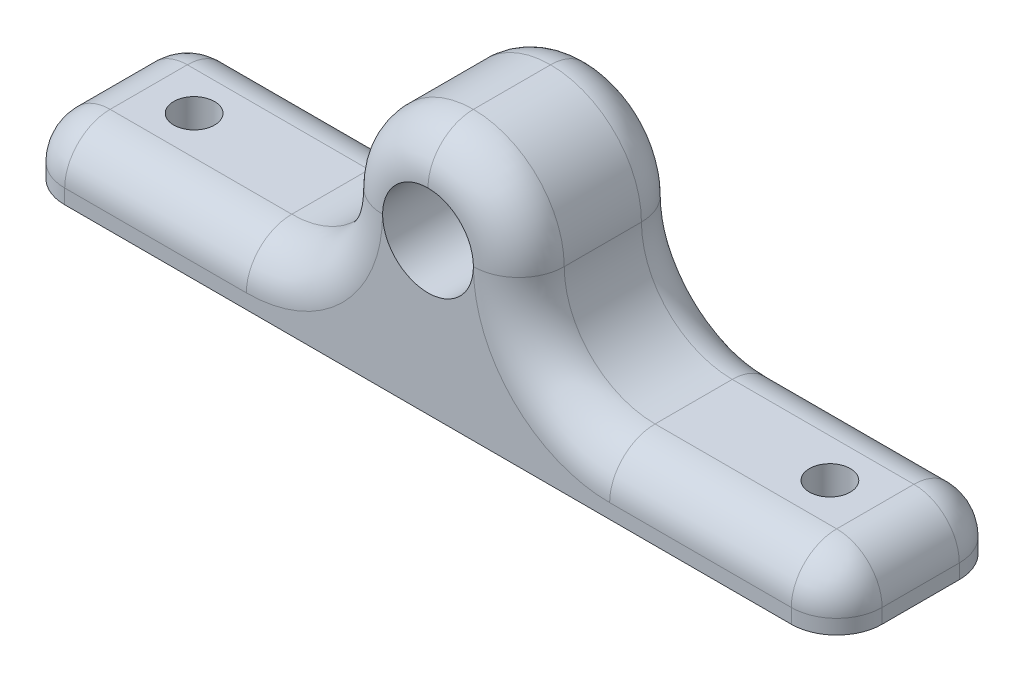
ISO-10303-21;
HEADER;
FILE_DESCRIPTION(('STEP AP214'),'2;1');
FILE_NAME('part.step','',(''),(''),'','','');
FILE_SCHEMA(('AUTOMOTIVE_DESIGN { 1 0 10303 214 1 1 1 1 }'));
ENDSEC;
DATA;
#1=APPLICATION_CONTEXT('core data for automotive mechanical design processes');
#2=APPLICATION_PROTOCOL_DEFINITION('international standard','automotive_design',2000,#1);
#3=PRODUCT_CONTEXT('',#1,'mechanical');
#4=PRODUCT('Part','Part','',(#3));
#5=PRODUCT_RELATED_PRODUCT_CATEGORY('part','',(#4));
#6=PRODUCT_DEFINITION_FORMATION('','',#4);
#7=PRODUCT_DEFINITION_CONTEXT('part definition',#1,'design');
#8=PRODUCT_DEFINITION('design','',#6,#7);
#9=PRODUCT_DEFINITION_SHAPE('','',#8);
#10=(LENGTH_UNIT() NAMED_UNIT(*) SI_UNIT(.MILLI.,.METRE.));
#11=(NAMED_UNIT(*) PLANE_ANGLE_UNIT() SI_UNIT($,.RADIAN.));
#12=(NAMED_UNIT(*) SI_UNIT($,.STERADIAN.) SOLID_ANGLE_UNIT());
#13=UNCERTAINTY_MEASURE_WITH_UNIT(LENGTH_MEASURE(1.E-05),#10,'distance_accuracy_value','');
#14=(GEOMETRIC_REPRESENTATION_CONTEXT(3) GLOBAL_UNCERTAINTY_ASSIGNED_CONTEXT((#13)) GLOBAL_UNIT_ASSIGNED_CONTEXT((#10,
#11,#12)) REPRESENTATION_CONTEXT('',''));
#15=CARTESIAN_POINT('',(0.,0.,0.));
#16=DIRECTION('',(0.,0.,1.));
#17=DIRECTION('',(1.,0.,0.));
#18=AXIS2_PLACEMENT_3D('',#15,#16,#17);
#19=CARTESIAN_POINT('',(0.,0.,18.5));
#20=DIRECTION('',(0.,0.,1.));
#21=DIRECTION('',(1.,0.,0.));
#22=AXIS2_PLACEMENT_3D('',#19,#20,#21);
#23=PLANE('',#22);
#24=CARTESIAN_POINT('',(-20.,0.,18.5));
#25=DIRECTION('',(0.,0.,1.));
#26=DIRECTION('',(1.,0.,0.));
#27=AXIS2_PLACEMENT_3D('',#24,#25,#26);
#28=CIRCLE('',#27,15.);
#29=CARTESIAN_POINT('',(-5.,0.,18.5));
#30=VERTEX_POINT('',#29);
#31=CARTESIAN_POINT('',(-20.,-15.,18.5));
#32=VERTEX_POINT('',#31);
#33=EDGE_CURVE('E255',#30,#32,#28,.F.);
#34=ORIENTED_EDGE('',*,*,#33,.T.);
#35=DIRECTION('',(-1.,0.,0.));
#36=VECTOR('',#35,1.);
#37=CARTESIAN_POINT('',(-40.,-15.,18.5));
#38=LINE('',#37,#36);
#39=CARTESIAN_POINT('',(-40.,-15.,18.5));
#40=VERTEX_POINT('',#39);
#41=EDGE_CURVE('E181',#32,#40,#38,.T.);
#42=ORIENTED_EDGE('',*,*,#41,.T.);
#43=DIRECTION('',(0.,-1.,0.));
#44=VECTOR('',#43,1.);
#45=CARTESIAN_POINT('',(-40.,-16.6,18.5));
#46=LINE('',#45,#44);
#47=CARTESIAN_POINT('',(-40.,-16.6,18.5));
#48=VERTEX_POINT('',#47);
#49=EDGE_CURVE('E174',#40,#48,#46,.T.);
#50=ORIENTED_EDGE('',*,*,#49,.T.);
#51=DIRECTION('',(1.,0.,0.));
#52=VECTOR('',#51,1.);
#53=CARTESIAN_POINT('',(-45.,-16.6,18.5));
#54=LINE('',#53,#52);
#55=CARTESIAN_POINT('',(40.,-16.6,18.5));
#56=VERTEX_POINT('',#55);
#57=EDGE_CURVE('E178',#48,#56,#54,.T.);
#58=ORIENTED_EDGE('',*,*,#57,.T.);
#59=DIRECTION('',(0.,1.,0.));
#60=VECTOR('',#59,1.);
#61=CARTESIAN_POINT('',(40.,-10.,18.5));
#62=LINE('',#61,#60);
#63=CARTESIAN_POINT('',(40.,-15.,18.5));
#64=VERTEX_POINT('',#63);
#65=EDGE_CURVE('E186',#56,#64,#62,.T.);
#66=ORIENTED_EDGE('',*,*,#65,.T.);
#67=DIRECTION('',(-1.,0.,0.));
#68=VECTOR('',#67,1.);
#69=CARTESIAN_POINT('',(20.,-15.,18.5));
#70=LINE('',#69,#68);
#71=CARTESIAN_POINT('',(20.,-15.,18.5));
#72=VERTEX_POINT('',#71);
#73=EDGE_CURVE('E251',#64,#72,#70,.T.);
#74=ORIENTED_EDGE('',*,*,#73,.T.);
#75=CARTESIAN_POINT('',(20.,0.,18.5));
#76=DIRECTION('',(0.,0.,1.));
#77=DIRECTION('',(1.,0.,0.));
#78=AXIS2_PLACEMENT_3D('',#75,#76,#77);
#79=CIRCLE('',#78,15.);
#80=CARTESIAN_POINT('',(5.,0.,18.5));
#81=VERTEX_POINT('',#80);
#82=EDGE_CURVE('E253',#72,#81,#79,.F.);
#83=ORIENTED_EDGE('',*,*,#82,.T.);
#84=CARTESIAN_POINT('',(0.,0.,18.5));
#85=DIRECTION('',(0.,0.,1.));
#86=DIRECTION('',(1.,0.,0.));
#87=AXIS2_PLACEMENT_3D('',#84,#85,#86);
#88=CIRCLE('',#87,5.);
#89=EDGE_CURVE('E370',#30,#81,#88,.T.);
#90=ORIENTED_EDGE('',*,*,#89,.F.);
#91=EDGE_LOOP('',(#34,#42,#50,#58,#66,#74,#83,#90));
#92=FACE_BOUND('',#91,.T.);
#93=ADVANCED_FACE('F36',(#92),#23,.T.);
#94=CARTESIAN_POINT('',(0.,0.,0.));
#95=DIRECTION('',(0.,0.,1.));
#96=DIRECTION('',(1.,0.,0.));
#97=AXIS2_PLACEMENT_3D('',#94,#95,#96);
#98=PLANE('',#97);
#99=CARTESIAN_POINT('',(20.,0.,0.));
#100=DIRECTION('',(0.,0.,1.));
#101=DIRECTION('',(1.,0.,0.));
#102=AXIS2_PLACEMENT_3D('',#99,#100,#101);
#103=CIRCLE('',#102,15.);
#104=CARTESIAN_POINT('',(5.,0.,0.));
#105=VERTEX_POINT('',#104);
#106=CARTESIAN_POINT('',(20.,-15.,0.));
#107=VERTEX_POINT('',#106);
#108=EDGE_CURVE('E59',#105,#107,#103,.T.);
#109=ORIENTED_EDGE('',*,*,#108,.T.);
#110=DIRECTION('',(-1.,0.,0.));
#111=VECTOR('',#110,1.);
#112=CARTESIAN_POINT('',(0.,-15.,0.));
#113=LINE('',#112,#111);
#114=CARTESIAN_POINT('',(40.,-15.,0.));
#115=VERTEX_POINT('',#114);
#116=EDGE_CURVE('E296',#107,#115,#113,.F.);
#117=ORIENTED_EDGE('',*,*,#116,.T.);
#118=DIRECTION('',(0.,1.,0.));
#119=VECTOR('',#118,1.);
#120=CARTESIAN_POINT('',(40.,0.,0.));
#121=LINE('',#120,#119);
#122=CARTESIAN_POINT('',(40.,-16.6,0.));
#123=VERTEX_POINT('',#122);
#124=EDGE_CURVE('E247',#115,#123,#121,.F.);
#125=ORIENTED_EDGE('',*,*,#124,.T.);
#126=DIRECTION('',(1.,0.,0.));
#127=VECTOR('',#126,1.);
#128=CARTESIAN_POINT('',(-45.,-16.6,0.));
#129=LINE('',#128,#127);
#130=CARTESIAN_POINT('',(-40.,-16.6,0.));
#131=VERTEX_POINT('',#130);
#132=EDGE_CURVE('E202',#131,#123,#129,.T.);
#133=ORIENTED_EDGE('',*,*,#132,.F.);
#134=DIRECTION('',(0.,-1.,0.));
#135=VECTOR('',#134,1.);
#136=CARTESIAN_POINT('',(-40.,0.,0.));
#137=LINE('',#136,#135);
#138=CARTESIAN_POINT('',(-40.,-15.,0.));
#139=VERTEX_POINT('',#138);
#140=EDGE_CURVE('E244',#131,#139,#137,.F.);
#141=ORIENTED_EDGE('',*,*,#140,.T.);
#142=DIRECTION('',(-1.,0.,0.));
#143=VECTOR('',#142,1.);
#144=CARTESIAN_POINT('',(0.,-15.,0.));
#145=LINE('',#144,#143);
#146=CARTESIAN_POINT('',(-20.,-15.,0.));
#147=VERTEX_POINT('',#146);
#148=EDGE_CURVE('E291',#139,#147,#145,.F.);
#149=ORIENTED_EDGE('',*,*,#148,.T.);
#150=CARTESIAN_POINT('',(-20.,0.,0.));
#151=DIRECTION('',(0.,0.,1.));
#152=DIRECTION('',(1.,0.,0.));
#153=AXIS2_PLACEMENT_3D('',#150,#151,#152);
#154=CIRCLE('',#153,15.);
#155=CARTESIAN_POINT('',(-5.,0.,0.));
#156=VERTEX_POINT('',#155);
#157=EDGE_CURVE('E293',#147,#156,#154,.T.);
#158=ORIENTED_EDGE('',*,*,#157,.T.);
#159=CARTESIAN_POINT('',(0.,0.,0.));
#160=DIRECTION('',(0.,0.,1.));
#161=DIRECTION('',(1.,0.,0.));
#162=AXIS2_PLACEMENT_3D('',#159,#160,#161);
#163=CIRCLE('',#162,5.);
#164=EDGE_CURVE('E231',#156,#105,#163,.T.);
#165=ORIENTED_EDGE('',*,*,#164,.T.);
#166=EDGE_LOOP('',(#109,#117,#125,#133,#141,#149,#158,#165));
#167=FACE_BOUND('',#166,.T.);
#168=ADVANCED_FACE('F384',(#167),#98,.F.);
#169=CARTESIAN_POINT('',(-45.,-10.,18.5));
#170=DIRECTION('',(0.,-1.,0.));
#171=DIRECTION('',(0.,0.,-1.));
#172=AXIS2_PLACEMENT_3D('',#169,#170,#171);
#173=PLANE('',#172);
#174=CARTESIAN_POINT('',(-35.,-10.,9.24999999999999));
#175=DIRECTION('',(0.,1.,0.));
#176=DIRECTION('',(0.,0.,1.));
#177=AXIS2_PLACEMENT_3D('',#174,#175,#176);
#178=CIRCLE('',#177,2.25);
#179=CARTESIAN_POINT('',(-35.,-10.,11.5));
#180=VERTEX_POINT('',#179);
#181=EDGE_CURVE('E354',#180,#180,#178,.T.);
#182=ORIENTED_EDGE('',*,*,#181,.F.);
#183=EDGE_LOOP('',(#182));
#184=FACE_BOUND('',#183,.T.);
#185=DIRECTION('',(0.,0.,-1.));
#186=VECTOR('',#185,1.);
#187=CARTESIAN_POINT('',(-40.,-10.,18.5));
#188=LINE('',#187,#186);
#189=CARTESIAN_POINT('',(-40.,-10.,5.));
#190=VERTEX_POINT('',#189);
#191=CARTESIAN_POINT('',(-40.,-10.,13.5));
#192=VERTEX_POINT('',#191);
#193=EDGE_CURVE('E258',#190,#192,#188,.F.);
#194=ORIENTED_EDGE('',*,*,#193,.T.);
#195=DIRECTION('',(-1.,0.,0.));
#196=VECTOR('',#195,1.);
#197=CARTESIAN_POINT('',(-20.,-10.,13.5));
#198=LINE('',#197,#196);
#199=CARTESIAN_POINT('',(-20.,-10.,13.5));
#200=VERTEX_POINT('',#199);
#201=EDGE_CURVE('E262',#192,#200,#198,.F.);
#202=ORIENTED_EDGE('',*,*,#201,.T.);
#203=DIRECTION('',(0.,0.,-1.));
#204=VECTOR('',#203,1.);
#205=CARTESIAN_POINT('',(-20.,-10.,0.));
#206=LINE('',#205,#204);
#207=CARTESIAN_POINT('',(-20.,-10.,5.));
#208=VERTEX_POINT('',#207);
#209=EDGE_CURVE('E218',#200,#208,#206,.T.);
#210=ORIENTED_EDGE('',*,*,#209,.T.);
#211=DIRECTION('',(-1.,0.,0.));
#212=VECTOR('',#211,1.);
#213=CARTESIAN_POINT('',(-45.,-10.,5.));
#214=LINE('',#213,#212);
#215=EDGE_CURVE('E260',#208,#190,#214,.T.);
#216=ORIENTED_EDGE('',*,*,#215,.T.);
#217=EDGE_LOOP('',(#194,#202,#210,#216));
#218=FACE_BOUND('',#217,.T.);
#219=ADVANCED_FACE('F434',(#184,#218),#173,.F.);
#220=CARTESIAN_POINT('',(-45.,-10.,18.5));
#221=DIRECTION('',(1.,0.,0.));
#222=DIRECTION('',(0.,1.,0.));
#223=AXIS2_PLACEMENT_3D('',#220,#221,#222);
#224=PLANE('',#223);
#225=DIRECTION('',(0.,-1.,0.));
#226=VECTOR('',#225,1.);
#227=CARTESIAN_POINT('',(-45.,-10.,13.5));
#228=LINE('',#227,#226);
#229=CARTESIAN_POINT('',(-45.,-16.6,13.5));
#230=VERTEX_POINT('',#229);
#231=CARTESIAN_POINT('',(-45.,-15.,13.5));
#232=VERTEX_POINT('',#231);
#233=EDGE_CURVE('E191',#230,#232,#228,.F.);
#234=ORIENTED_EDGE('',*,*,#233,.T.);
#235=DIRECTION('',(0.,0.,-1.));
#236=VECTOR('',#235,1.);
#237=CARTESIAN_POINT('',(-45.,-15.,18.5));
#238=LINE('',#237,#236);
#239=CARTESIAN_POINT('',(-45.,-15.,5.));
#240=VERTEX_POINT('',#239);
#241=EDGE_CURVE('E11',#232,#240,#238,.T.);
#242=ORIENTED_EDGE('',*,*,#241,.T.);
#243=DIRECTION('',(0.,-1.,0.));
#244=VECTOR('',#243,1.);
#245=CARTESIAN_POINT('',(-45.,-10.,5.));
#246=LINE('',#245,#244);
#247=CARTESIAN_POINT('',(-45.,-16.6,5.));
#248=VERTEX_POINT('',#247);
#249=EDGE_CURVE('E195',#240,#248,#246,.T.);
#250=ORIENTED_EDGE('',*,*,#249,.T.);
#251=DIRECTION('',(0.,0.,-1.));
#252=VECTOR('',#251,1.);
#253=CARTESIAN_POINT('',(-45.,-16.6,18.5));
#254=LINE('',#253,#252);
#255=EDGE_CURVE('E205',#230,#248,#254,.T.);
#256=ORIENTED_EDGE('',*,*,#255,.F.);
#257=EDGE_LOOP('',(#234,#242,#250,#256));
#258=FACE_BOUND('',#257,.T.);
#259=ADVANCED_FACE('F442',(#258),#224,.F.);
#260=CARTESIAN_POINT('',(-45.,-16.6,18.5));
#261=DIRECTION('',(0.,1.,0.));
#262=DIRECTION('',(0.,0.,1.));
#263=AXIS2_PLACEMENT_3D('',#260,#261,#262);
#264=PLANE('',#263);
#265=CARTESIAN_POINT('',(-35.,-16.6,9.24999999999999));
#266=DIRECTION('',(0.,1.,0.));
#267=DIRECTION('',(0.,0.,1.));
#268=AXIS2_PLACEMENT_3D('',#265,#266,#267);
#269=CIRCLE('',#268,2.25);
#270=CARTESIAN_POINT('',(-35.,-16.6,11.5));
#271=VERTEX_POINT('',#270);
#272=EDGE_CURVE('E358',#271,#271,#269,.T.);
#273=ORIENTED_EDGE('',*,*,#272,.T.);
#274=EDGE_LOOP('',(#273));
#275=FACE_BOUND('',#274,.T.);
#276=CARTESIAN_POINT('',(35.,-16.6,9.24999999999999));
#277=DIRECTION('',(0.,1.,0.));
#278=DIRECTION('',(0.,0.,1.));
#279=AXIS2_PLACEMENT_3D('',#276,#277,#278);
#280=CIRCLE('',#279,2.25);
#281=CARTESIAN_POINT('',(35.,-16.6,11.5));
#282=VERTEX_POINT('',#281);
#283=EDGE_CURVE('E225',#282,#282,#280,.T.);
#284=ORIENTED_EDGE('',*,*,#283,.T.);
#285=EDGE_LOOP('',(#284));
#286=FACE_BOUND('',#285,.T.);
#287=ORIENTED_EDGE('',*,*,#57,.F.);
#288=CARTESIAN_POINT('',(-40.,-16.6,13.5));
#289=DIRECTION('',(0.,1.,0.));
#290=DIRECTION('',(0.,0.,1.));
#291=AXIS2_PLACEMENT_3D('',#288,#289,#290);
#292=CIRCLE('',#291,5.);
#293=EDGE_CURVE('E189',#48,#230,#292,.F.);
#294=ORIENTED_EDGE('',*,*,#293,.T.);
#295=ORIENTED_EDGE('',*,*,#255,.T.);
#296=CARTESIAN_POINT('',(-40.,-16.6,5.));
#297=DIRECTION('',(0.,1.,0.));
#298=DIRECTION('',(0.,0.,1.));
#299=AXIS2_PLACEMENT_3D('',#296,#297,#298);
#300=CIRCLE('',#299,5.);
#301=EDGE_CURVE('E185',#248,#131,#300,.F.);
#302=ORIENTED_EDGE('',*,*,#301,.T.);
#303=ORIENTED_EDGE('',*,*,#132,.T.);
#304=CARTESIAN_POINT('',(40.,-16.6,5.));
#305=DIRECTION('',(0.,1.,0.));
#306=DIRECTION('',(0.,0.,1.));
#307=AXIS2_PLACEMENT_3D('',#304,#305,#306);
#308=CIRCLE('',#307,5.);
#309=CARTESIAN_POINT('',(45.,-16.6,5.));
#310=VERTEX_POINT('',#309);
#311=EDGE_CURVE('E234',#123,#310,#308,.F.);
#312=ORIENTED_EDGE('',*,*,#311,.T.);
#313=DIRECTION('',(0.,0.,-1.));
#314=VECTOR('',#313,1.);
#315=CARTESIAN_POINT('',(45.,-16.6,18.5));
#316=LINE('',#315,#314);
#317=CARTESIAN_POINT('',(45.,-16.6,13.5));
#318=VERTEX_POINT('',#317);
#319=EDGE_CURVE('E201',#318,#310,#316,.T.);
#320=ORIENTED_EDGE('',*,*,#319,.F.);
#321=CARTESIAN_POINT('',(40.,-16.6,13.5));
#322=DIRECTION('',(0.,1.,0.));
#323=DIRECTION('',(0.,0.,1.));
#324=AXIS2_PLACEMENT_3D('',#321,#322,#323);
#325=CIRCLE('',#324,5.);
#326=EDGE_CURVE('E196',#318,#56,#325,.F.);
#327=ORIENTED_EDGE('',*,*,#326,.T.);
#328=EDGE_LOOP('',(#287,#294,#295,#302,#303,#312,#320,#327));
#329=FACE_BOUND('',#328,.T.);
#330=ADVANCED_FACE('F198',(#275,#286,#329),#264,.F.);
#331=CARTESIAN_POINT('',(45.,-10.,18.5));
#332=DIRECTION('',(-1.,0.,0.));
#333=DIRECTION('',(0.,0.,1.));
#334=AXIS2_PLACEMENT_3D('',#331,#332,#333);
#335=PLANE('',#334);
#336=DIRECTION('',(0.,1.,0.));
#337=VECTOR('',#336,1.);
#338=CARTESIAN_POINT('',(45.,-10.,5.));
#339=LINE('',#338,#337);
#340=CARTESIAN_POINT('',(45.,-15.,5.));
#341=VERTEX_POINT('',#340);
#342=EDGE_CURVE('E239',#310,#341,#339,.T.);
#343=ORIENTED_EDGE('',*,*,#342,.T.);
#344=DIRECTION('',(0.,0.,-1.));
#345=VECTOR('',#344,1.);
#346=CARTESIAN_POINT('',(45.,-15.,18.5));
#347=LINE('',#346,#345);
#348=CARTESIAN_POINT('',(45.,-15.,13.5));
#349=VERTEX_POINT('',#348);
#350=EDGE_CURVE('E45',#341,#349,#347,.F.);
#351=ORIENTED_EDGE('',*,*,#350,.T.);
#352=DIRECTION('',(0.,1.,0.));
#353=VECTOR('',#352,1.);
#354=CARTESIAN_POINT('',(45.,-16.6,13.5));
#355=LINE('',#354,#353);
#356=EDGE_CURVE('E242',#349,#318,#355,.F.);
#357=ORIENTED_EDGE('',*,*,#356,.T.);
#358=ORIENTED_EDGE('',*,*,#319,.T.);
#359=EDGE_LOOP('',(#343,#351,#357,#358));
#360=FACE_BOUND('',#359,.T.);
#361=ADVANCED_FACE('F425',(#360),#335,.F.);
#362=CARTESIAN_POINT('',(10.,-10.,18.5));
#363=DIRECTION('',(0.,-1.,0.));
#364=DIRECTION('',(0.,0.,-1.));
#365=AXIS2_PLACEMENT_3D('',#362,#363,#364);
#366=PLANE('',#365);
#367=DIRECTION('',(0.,0.,-1.));
#368=VECTOR('',#367,1.);
#369=CARTESIAN_POINT('',(20.,-10.,18.5));
#370=LINE('',#369,#368);
#371=CARTESIAN_POINT('',(20.,-10.,5.));
#372=VERTEX_POINT('',#371);
#373=CARTESIAN_POINT('',(20.,-10.,13.5));
#374=VERTEX_POINT('',#373);
#375=EDGE_CURVE('E215',#372,#374,#370,.F.);
#376=ORIENTED_EDGE('',*,*,#375,.T.);
#377=DIRECTION('',(-1.,0.,0.));
#378=VECTOR('',#377,1.);
#379=CARTESIAN_POINT('',(40.,-10.,13.5));
#380=LINE('',#379,#378);
#381=CARTESIAN_POINT('',(40.,-10.,13.5));
#382=VERTEX_POINT('',#381);
#383=EDGE_CURVE('E285',#374,#382,#380,.F.);
#384=ORIENTED_EDGE('',*,*,#383,.T.);
#385=DIRECTION('',(0.,0.,-1.));
#386=VECTOR('',#385,1.);
#387=CARTESIAN_POINT('',(40.,-10.,18.5));
#388=LINE('',#387,#386);
#389=CARTESIAN_POINT('',(40.,-10.,5.));
#390=VERTEX_POINT('',#389);
#391=EDGE_CURVE('E281',#382,#390,#388,.T.);
#392=ORIENTED_EDGE('',*,*,#391,.T.);
#393=DIRECTION('',(-1.,0.,0.));
#394=VECTOR('',#393,1.);
#395=CARTESIAN_POINT('',(10.,-10.,5.));
#396=LINE('',#395,#394);
#397=EDGE_CURVE('E283',#390,#372,#396,.T.);
#398=ORIENTED_EDGE('',*,*,#397,.T.);
#399=EDGE_LOOP('',(#376,#384,#392,#398));
#400=FACE_BOUND('',#399,.T.);
#401=CARTESIAN_POINT('',(35.,-10.,9.24999999999999));
#402=DIRECTION('',(0.,1.,0.));
#403=DIRECTION('',(0.,0.,1.));
#404=AXIS2_PLACEMENT_3D('',#401,#402,#403);
#405=CIRCLE('',#404,2.25);
#406=CARTESIAN_POINT('',(35.,-10.,11.5));
#407=VERTEX_POINT('',#406);
#408=EDGE_CURVE('E363',#407,#407,#405,.T.);
#409=ORIENTED_EDGE('',*,*,#408,.F.);
#410=EDGE_LOOP('',(#409));
#411=FACE_BOUND('',#410,.T.);
#412=ADVANCED_FACE('F417',(#400,#411),#366,.F.);
#413=CARTESIAN_POINT('',(0.,0.,18.5));
#414=DIRECTION('',(0.,0.,-1.));
#415=DIRECTION('',(-1.,0.,0.));
#416=AXIS2_PLACEMENT_3D('',#413,#414,#415);
#417=CYLINDRICAL_SURFACE('',#416,5.);
#418=CARTESIAN_POINT('',(0.,5.,18.5));
#419=VERTEX_POINT('',#418);
#420=EDGE_CURVE('E208',#81,#419,#88,.T.);
#421=ORIENTED_EDGE('',*,*,#420,.T.);
#422=EDGE_CURVE('E369',#419,#30,#88,.T.);
#423=ORIENTED_EDGE('',*,*,#422,.T.);
#424=ORIENTED_EDGE('',*,*,#89,.T.);
#425=EDGE_LOOP('',(#421,#423,#424));
#426=FACE_BOUND('',#425,.T.);
#427=CARTESIAN_POINT('',(0.,5.,0.));
#428=VERTEX_POINT('',#427);
#429=EDGE_CURVE('E211',#105,#428,#163,.T.);
#430=ORIENTED_EDGE('',*,*,#429,.F.);
#431=ORIENTED_EDGE('',*,*,#164,.F.);
#432=EDGE_CURVE('E378',#428,#156,#163,.T.);
#433=ORIENTED_EDGE('',*,*,#432,.F.);
#434=EDGE_LOOP('',(#430,#431,#433));
#435=FACE_BOUND('',#434,.T.);
#436=ADVANCED_FACE('F387',(#426,#435),#417,.F.);
#437=CARTESIAN_POINT('',(-20.,0.,18.5));
#438=DIRECTION('',(0.,0.,1.));
#439=DIRECTION('',(1.,0.,0.));
#440=AXIS2_PLACEMENT_3D('',#437,#438,#439);
#441=CYLINDRICAL_SURFACE('',#440,10.);
#442=ORIENTED_EDGE('',*,*,#209,.F.);
#443=CARTESIAN_POINT('',(-20.,0.,13.5));
#444=DIRECTION('',(0.,0.,1.));
#445=DIRECTION('',(1.,0.,0.));
#446=AXIS2_PLACEMENT_3D('',#443,#444,#445);
#447=CIRCLE('',#446,10.);
#448=CARTESIAN_POINT('',(-10.,0.,13.5));
#449=VERTEX_POINT('',#448);
#450=EDGE_CURVE('E267',#200,#449,#447,.T.);
#451=ORIENTED_EDGE('',*,*,#450,.T.);
#452=DIRECTION('',(0.,0.,-1.));
#453=VECTOR('',#452,1.);
#454=CARTESIAN_POINT('',(-10.,0.,18.5));
#455=LINE('',#454,#453);
#456=CARTESIAN_POINT('',(-10.,0.,5.));
#457=VERTEX_POINT('',#456);
#458=EDGE_CURVE('E228',#457,#449,#455,.F.);
#459=ORIENTED_EDGE('',*,*,#458,.F.);
#460=CARTESIAN_POINT('',(-20.,0.,5.));
#461=DIRECTION('',(0.,0.,1.));
#462=DIRECTION('',(1.,0.,0.));
#463=AXIS2_PLACEMENT_3D('',#460,#461,#462);
#464=CIRCLE('',#463,10.);
#465=EDGE_CURVE('E265',#457,#208,#464,.F.);
#466=ORIENTED_EDGE('',*,*,#465,.T.);
#467=EDGE_LOOP('',(#442,#451,#459,#466));
#468=FACE_BOUND('',#467,.T.);
#469=ADVANCED_FACE('F416',(#468),#441,.F.);
#470=CARTESIAN_POINT('',(0.,0.,18.5));
#471=DIRECTION('',(0.,0.,-1.));
#472=DIRECTION('',(-1.,0.,0.));
#473=AXIS2_PLACEMENT_3D('',#470,#471,#472);
#474=CYLINDRICAL_SURFACE('',#473,10.);
#475=ORIENTED_EDGE('',*,*,#458,.T.);
#476=CARTESIAN_POINT('',(0.,0.,13.5));
#477=DIRECTION('',(0.,0.,1.));
#478=DIRECTION('',(1.,0.,0.));
#479=AXIS2_PLACEMENT_3D('',#476,#477,#478);
#480=CIRCLE('',#479,10.);
#481=CARTESIAN_POINT('',(0.,10.,13.5));
#482=VERTEX_POINT('',#481);
#483=EDGE_CURVE('E271',#449,#482,#480,.F.);
#484=ORIENTED_EDGE('',*,*,#483,.T.);
#485=DIRECTION('',(0.,0.,-1.));
#486=VECTOR('',#485,1.);
#487=CARTESIAN_POINT('',(0.,10.,18.5));
#488=LINE('',#487,#486);
#489=CARTESIAN_POINT('',(0.,10.,5.));
#490=VERTEX_POINT('',#489);
#491=EDGE_CURVE('E224',#490,#482,#488,.F.);
#492=ORIENTED_EDGE('',*,*,#491,.F.);
#493=CARTESIAN_POINT('',(0.,0.,5.));
#494=DIRECTION('',(0.,0.,1.));
#495=DIRECTION('',(1.,0.,0.));
#496=AXIS2_PLACEMENT_3D('',#493,#494,#495);
#497=CIRCLE('',#496,10.);
#498=EDGE_CURVE('E269',#490,#457,#497,.T.);
#499=ORIENTED_EDGE('',*,*,#498,.T.);
#500=EDGE_LOOP('',(#475,#484,#492,#499));
#501=FACE_BOUND('',#500,.T.);
#502=ADVANCED_FACE('F402',(#501),#474,.T.);
#503=CARTESIAN_POINT('',(0.,0.,18.5));
#504=DIRECTION('',(0.,0.,-1.));
#505=DIRECTION('',(-1.,0.,0.));
#506=AXIS2_PLACEMENT_3D('',#503,#504,#505);
#507=CYLINDRICAL_SURFACE('',#506,10.);
#508=ORIENTED_EDGE('',*,*,#491,.T.);
#509=CARTESIAN_POINT('',(0.,0.,13.5));
#510=DIRECTION('',(0.,0.,1.));
#511=DIRECTION('',(1.,0.,0.));
#512=AXIS2_PLACEMENT_3D('',#509,#510,#511);
#513=CIRCLE('',#512,10.);
#514=CARTESIAN_POINT('',(10.,0.,13.5));
#515=VERTEX_POINT('',#514);
#516=EDGE_CURVE('E275',#482,#515,#513,.F.);
#517=ORIENTED_EDGE('',*,*,#516,.T.);
#518=DIRECTION('',(0.,0.,-1.));
#519=VECTOR('',#518,1.);
#520=CARTESIAN_POINT('',(10.,0.,18.5));
#521=LINE('',#520,#519);
#522=CARTESIAN_POINT('',(10.,0.,5.));
#523=VERTEX_POINT('',#522);
#524=EDGE_CURVE('E221',#523,#515,#521,.F.);
#525=ORIENTED_EDGE('',*,*,#524,.F.);
#526=CARTESIAN_POINT('',(0.,0.,5.));
#527=DIRECTION('',(0.,0.,1.));
#528=DIRECTION('',(1.,0.,0.));
#529=AXIS2_PLACEMENT_3D('',#526,#527,#528);
#530=CIRCLE('',#529,10.);
#531=EDGE_CURVE('E273',#523,#490,#530,.T.);
#532=ORIENTED_EDGE('',*,*,#531,.T.);
#533=EDGE_LOOP('',(#508,#517,#525,#532));
#534=FACE_BOUND('',#533,.T.);
#535=ADVANCED_FACE('F399',(#534),#507,.T.);
#536=CARTESIAN_POINT('',(20.,0.,18.5));
#537=DIRECTION('',(0.,0.,1.));
#538=DIRECTION('',(1.,0.,0.));
#539=AXIS2_PLACEMENT_3D('',#536,#537,#538);
#540=CYLINDRICAL_SURFACE('',#539,10.);
#541=ORIENTED_EDGE('',*,*,#524,.T.);
#542=CARTESIAN_POINT('',(20.,0.,13.5));
#543=DIRECTION('',(0.,0.,1.));
#544=DIRECTION('',(1.,0.,0.));
#545=AXIS2_PLACEMENT_3D('',#542,#543,#544);
#546=CIRCLE('',#545,10.);
#547=EDGE_CURVE('E279',#515,#374,#546,.T.);
#548=ORIENTED_EDGE('',*,*,#547,.T.);
#549=ORIENTED_EDGE('',*,*,#375,.F.);
#550=CARTESIAN_POINT('',(20.,0.,5.));
#551=DIRECTION('',(0.,0.,1.));
#552=DIRECTION('',(1.,0.,0.));
#553=AXIS2_PLACEMENT_3D('',#550,#551,#552);
#554=CIRCLE('',#553,10.);
#555=EDGE_CURVE('E277',#372,#523,#554,.F.);
#556=ORIENTED_EDGE('',*,*,#555,.T.);
#557=EDGE_LOOP('',(#541,#548,#549,#556));
#558=FACE_BOUND('',#557,.T.);
#559=ADVANCED_FACE('F449',(#558),#540,.F.);
#560=CARTESIAN_POINT('',(35.,-10.,9.24999999999999));
#561=DIRECTION('',(0.,1.,0.));
#562=DIRECTION('',(0.,0.,1.));
#563=AXIS2_PLACEMENT_3D('',#560,#561,#562);
#564=CYLINDRICAL_SURFACE('',#563,2.25);
#565=ORIENTED_EDGE('',*,*,#283,.F.);
#566=EDGE_LOOP('',(#565));
#567=FACE_BOUND('',#566,.T.);
#568=ORIENTED_EDGE('',*,*,#408,.T.);
#569=EDGE_LOOP('',(#568));
#570=FACE_BOUND('',#569,.T.);
#571=ADVANCED_FACE('F452',(#567,#570),#564,.F.);
#572=CARTESIAN_POINT('',(-35.,-10.,9.24999999999999));
#573=DIRECTION('',(0.,1.,0.));
#574=DIRECTION('',(0.,0.,1.));
#575=AXIS2_PLACEMENT_3D('',#572,#573,#574);
#576=CYLINDRICAL_SURFACE('',#575,2.25);
#577=ORIENTED_EDGE('',*,*,#272,.F.);
#578=EDGE_LOOP('',(#577));
#579=FACE_BOUND('',#578,.T.);
#580=ORIENTED_EDGE('',*,*,#181,.T.);
#581=EDGE_LOOP('',(#580));
#582=FACE_BOUND('',#581,.T.);
#583=ADVANCED_FACE('F461',(#579,#582),#576,.F.);
#584=CARTESIAN_POINT('',(-40.,0.,13.5));
#585=DIRECTION('',(0.,1.,0.));
#586=DIRECTION('',(-1.,0.,0.));
#587=AXIS2_PLACEMENT_3D('',#584,#585,#586);
#588=CYLINDRICAL_SURFACE('',#587,5.);
#589=ORIENTED_EDGE('',*,*,#49,.F.);
#590=CARTESIAN_POINT('',(-40.,-15.,13.5));
#591=DIRECTION('',(0.,1.,0.));
#592=DIRECTION('',(-1.,0.,0.));
#593=AXIS2_PLACEMENT_3D('',#590,#591,#592);
#594=CIRCLE('',#593,5.);
#595=EDGE_CURVE('E249',#40,#232,#594,.F.);
#596=ORIENTED_EDGE('',*,*,#595,.T.);
#597=ORIENTED_EDGE('',*,*,#233,.F.);
#598=ORIENTED_EDGE('',*,*,#293,.F.);
#599=EDGE_LOOP('',(#589,#596,#597,#598));
#600=FACE_BOUND('',#599,.T.);
#601=ADVANCED_FACE('F190',(#600),#588,.T.);
#602=CARTESIAN_POINT('',(40.,0.,13.5));
#603=DIRECTION('',(0.,-1.,0.));
#604=DIRECTION('',(0.,0.,-1.));
#605=AXIS2_PLACEMENT_3D('',#602,#603,#604);
#606=CYLINDRICAL_SURFACE('',#605,5.);
#607=ORIENTED_EDGE('',*,*,#356,.F.);
#608=CARTESIAN_POINT('',(40.,-15.,13.5));
#609=DIRECTION('',(0.,-1.,0.));
#610=DIRECTION('',(0.,0.,-1.));
#611=AXIS2_PLACEMENT_3D('',#608,#609,#610);
#612=CIRCLE('',#611,5.);
#613=EDGE_CURVE('E287',#349,#64,#612,.T.);
#614=ORIENTED_EDGE('',*,*,#613,.T.);
#615=ORIENTED_EDGE('',*,*,#65,.F.);
#616=ORIENTED_EDGE('',*,*,#326,.F.);
#617=EDGE_LOOP('',(#607,#614,#615,#616));
#618=FACE_BOUND('',#617,.T.);
#619=ADVANCED_FACE('F460',(#618),#606,.T.);
#620=CARTESIAN_POINT('',(40.,-10.,5.));
#621=DIRECTION('',(0.,1.,0.));
#622=DIRECTION('',(0.,0.,1.));
#623=AXIS2_PLACEMENT_3D('',#620,#621,#622);
#624=CYLINDRICAL_SURFACE('',#623,5.);
#625=ORIENTED_EDGE('',*,*,#124,.F.);
#626=CARTESIAN_POINT('',(40.,-15.,5.));
#627=DIRECTION('',(0.,1.,0.));
#628=DIRECTION('',(0.,0.,1.));
#629=AXIS2_PLACEMENT_3D('',#626,#627,#628);
#630=CIRCLE('',#629,5.);
#631=EDGE_CURVE('E289',#115,#341,#630,.F.);
#632=ORIENTED_EDGE('',*,*,#631,.T.);
#633=ORIENTED_EDGE('',*,*,#342,.F.);
#634=ORIENTED_EDGE('',*,*,#311,.F.);
#635=EDGE_LOOP('',(#625,#632,#633,#634));
#636=FACE_BOUND('',#635,.T.);
#637=ADVANCED_FACE('F464',(#636),#624,.T.);
#638=CARTESIAN_POINT('',(-40.,-10.,5.));
#639=DIRECTION('',(0.,-1.,0.));
#640=DIRECTION('',(1.,0.,0.));
#641=AXIS2_PLACEMENT_3D('',#638,#639,#640);
#642=CYLINDRICAL_SURFACE('',#641,5.);
#643=ORIENTED_EDGE('',*,*,#249,.F.);
#644=CARTESIAN_POINT('',(-40.,-15.,5.));
#645=DIRECTION('',(0.,-1.,0.));
#646=DIRECTION('',(1.,0.,0.));
#647=AXIS2_PLACEMENT_3D('',#644,#645,#646);
#648=CIRCLE('',#647,5.);
#649=EDGE_CURVE('E298',#240,#139,#648,.T.);
#650=ORIENTED_EDGE('',*,*,#649,.T.);
#651=ORIENTED_EDGE('',*,*,#140,.F.);
#652=ORIENTED_EDGE('',*,*,#301,.F.);
#653=EDGE_LOOP('',(#643,#650,#651,#652));
#654=FACE_BOUND('',#653,.T.);
#655=ADVANCED_FACE('F468',(#654),#642,.T.);
#656=CARTESIAN_POINT('',(40.,-15.,5.));
#657=DIRECTION('',(0.,-1.,0.));
#658=DIRECTION('',(0.,0.,-1.));
#659=AXIS2_PLACEMENT_3D('',#656,#657,#658);
#660=SPHERICAL_SURFACE('',#659,5.);
#661=CARTESIAN_POINT('',(40.,-15.,5.));
#662=DIRECTION('',(0.,0.,1.));
#663=DIRECTION('',(1.,0.,0.));
#664=AXIS2_PLACEMENT_3D('',#661,#662,#663);
#665=CIRCLE('',#664,5.);
#666=EDGE_CURVE('E346',#341,#390,#665,.T.);
#667=ORIENTED_EDGE('',*,*,#666,.F.);
#668=ORIENTED_EDGE('',*,*,#631,.F.);
#669=CARTESIAN_POINT('',(40.,-15.,5.));
#670=DIRECTION('',(-1.,0.,0.));
#671=DIRECTION('',(0.,0.,1.));
#672=AXIS2_PLACEMENT_3D('',#669,#670,#671);
#673=CIRCLE('',#672,5.);
#674=EDGE_CURVE('E40',#390,#115,#673,.T.);
#675=ORIENTED_EDGE('',*,*,#674,.F.);
#676=EDGE_LOOP('',(#667,#668,#675));
#677=FACE_BOUND('',#676,.T.);
#678=ADVANCED_FACE('F38',(#677),#660,.T.);
#679=CARTESIAN_POINT('',(10.,-15.,5.));
#680=DIRECTION('',(-1.,0.,0.));
#681=DIRECTION('',(0.,0.,1.));
#682=AXIS2_PLACEMENT_3D('',#679,#680,#681);
#683=CYLINDRICAL_SURFACE('',#682,5.);
#684=ORIENTED_EDGE('',*,*,#674,.T.);
#685=ORIENTED_EDGE('',*,*,#116,.F.);
#686=CARTESIAN_POINT('',(20.,-15.,5.));
#687=DIRECTION('',(-1.,0.,0.));
#688=DIRECTION('',(0.,0.,1.));
#689=AXIS2_PLACEMENT_3D('',#686,#687,#688);
#690=CIRCLE('',#689,5.);
#691=EDGE_CURVE('E344',#372,#107,#690,.T.);
#692=ORIENTED_EDGE('',*,*,#691,.F.);
#693=ORIENTED_EDGE('',*,*,#397,.F.);
#694=EDGE_LOOP('',(#684,#685,#692,#693));
#695=FACE_BOUND('',#694,.T.);
#696=ADVANCED_FACE('F527',(#695),#683,.T.);
#697=CARTESIAN_POINT('',(40.,-15.,18.5));
#698=DIRECTION('',(0.,0.,-1.));
#699=DIRECTION('',(-1.,0.,0.));
#700=AXIS2_PLACEMENT_3D('',#697,#698,#699);
#701=CYLINDRICAL_SURFACE('',#700,5.);
#702=ORIENTED_EDGE('',*,*,#666,.T.);
#703=ORIENTED_EDGE('',*,*,#391,.F.);
#704=CARTESIAN_POINT('',(40.,-15.,13.5));
#705=DIRECTION('',(0.,0.,1.));
#706=DIRECTION('',(1.,0.,0.));
#707=AXIS2_PLACEMENT_3D('',#704,#705,#706);
#708=CIRCLE('',#707,5.);
#709=EDGE_CURVE('E341',#349,#382,#708,.T.);
#710=ORIENTED_EDGE('',*,*,#709,.F.);
#711=ORIENTED_EDGE('',*,*,#350,.F.);
#712=EDGE_LOOP('',(#702,#703,#710,#711));
#713=FACE_BOUND('',#712,.T.);
#714=ADVANCED_FACE('F525',(#713),#701,.T.);
#715=CARTESIAN_POINT('',(20.,0.,5.));
#716=DIRECTION('',(0.,0.,1.));
#717=DIRECTION('',(1.,0.,0.));
#718=AXIS2_PLACEMENT_3D('',#715,#716,#717);
#719=TOROIDAL_SURFACE('',#718,15.,5.);
#720=ORIENTED_EDGE('',*,*,#691,.T.);
#721=ORIENTED_EDGE('',*,*,#108,.F.);
#722=CARTESIAN_POINT('',(5.,0.,5.));
#723=DIRECTION('',(0.,1.,0.));
#724=DIRECTION('',(-1.,0.,0.));
#725=AXIS2_PLACEMENT_3D('',#722,#723,#724);
#726=CIRCLE('',#725,5.);
#727=EDGE_CURVE('E338',#523,#105,#726,.T.);
#728=ORIENTED_EDGE('',*,*,#727,.F.);
#729=ORIENTED_EDGE('',*,*,#555,.F.);
#730=EDGE_LOOP('',(#720,#721,#728,#729));
#731=FACE_BOUND('',#730,.T.);
#732=ADVANCED_FACE('F390',(#731),#719,.T.);
#733=CARTESIAN_POINT('',(40.,-15.,13.5));
#734=DIRECTION('',(0.,-1.,0.));
#735=DIRECTION('',(0.,0.,-1.));
#736=AXIS2_PLACEMENT_3D('',#733,#734,#735);
#737=SPHERICAL_SURFACE('',#736,5.);
#738=ORIENTED_EDGE('',*,*,#613,.F.);
#739=ORIENTED_EDGE('',*,*,#709,.T.);
#740=CARTESIAN_POINT('',(40.,-15.,13.5));
#741=DIRECTION('',(-1.,0.,0.));
#742=DIRECTION('',(0.,0.,1.));
#743=AXIS2_PLACEMENT_3D('',#740,#741,#742);
#744=CIRCLE('',#743,5.);
#745=EDGE_CURVE('E335',#64,#382,#744,.T.);
#746=ORIENTED_EDGE('',*,*,#745,.F.);
#747=EDGE_LOOP('',(#738,#739,#746));
#748=FACE_BOUND('',#747,.T.);
#749=ADVANCED_FACE('F519',(#748),#737,.T.);
#750=CARTESIAN_POINT('',(0.,0.,5.));
#751=DIRECTION('',(0.,0.,1.));
#752=DIRECTION('',(1.,0.,0.));
#753=AXIS2_PLACEMENT_3D('',#750,#751,#752);
#754=DEGENERATE_TOROIDAL_SURFACE('',#753,5.,5.,.T.);
#755=ORIENTED_EDGE('',*,*,#727,.T.);
#756=ORIENTED_EDGE('',*,*,#429,.T.);
#757=CARTESIAN_POINT('',(0.,5.,5.));
#758=DIRECTION('',(-1.,0.,0.));
#759=DIRECTION('',(0.,-1.,0.));
#760=AXIS2_PLACEMENT_3D('',#757,#758,#759);
#761=CIRCLE('',#760,5.);
#762=EDGE_CURVE('E332',#490,#428,#761,.T.);
#763=ORIENTED_EDGE('',*,*,#762,.F.);
#764=ORIENTED_EDGE('',*,*,#531,.F.);
#765=EDGE_LOOP('',(#755,#756,#763,#764));
#766=FACE_BOUND('',#765,.T.);
#767=ADVANCED_FACE('F394',(#766),#754,.T.);
#768=CARTESIAN_POINT('',(0.,-15.,13.5));
#769=DIRECTION('',(1.,0.,0.));
#770=DIRECTION('',(0.,0.,-1.));
#771=AXIS2_PLACEMENT_3D('',#768,#769,#770);
#772=CYLINDRICAL_SURFACE('',#771,5.);
#773=ORIENTED_EDGE('',*,*,#745,.T.);
#774=ORIENTED_EDGE('',*,*,#383,.F.);
#775=CARTESIAN_POINT('',(20.,-15.,13.5));
#776=DIRECTION('',(-1.,0.,0.));
#777=DIRECTION('',(0.,0.,1.));
#778=AXIS2_PLACEMENT_3D('',#775,#776,#777);
#779=CIRCLE('',#778,5.);
#780=EDGE_CURVE('E329',#72,#374,#779,.T.);
#781=ORIENTED_EDGE('',*,*,#780,.F.);
#782=ORIENTED_EDGE('',*,*,#73,.F.);
#783=EDGE_LOOP('',(#773,#774,#781,#782));
#784=FACE_BOUND('',#783,.T.);
#785=ADVANCED_FACE('F512',(#784),#772,.T.);
#786=CARTESIAN_POINT('',(0.,0.,5.));
#787=DIRECTION('',(0.,0.,1.));
#788=DIRECTION('',(1.,0.,0.));
#789=AXIS2_PLACEMENT_3D('',#786,#787,#788);
#790=DEGENERATE_TOROIDAL_SURFACE('',#789,5.,5.,.T.);
#791=ORIENTED_EDGE('',*,*,#762,.T.);
#792=ORIENTED_EDGE('',*,*,#432,.T.);
#793=CARTESIAN_POINT('',(-5.,0.,5.));
#794=DIRECTION('',(0.,-1.,0.));
#795=DIRECTION('',(1.,0.,0.));
#796=AXIS2_PLACEMENT_3D('',#793,#794,#795);
#797=CIRCLE('',#796,5.);
#798=EDGE_CURVE('E326',#457,#156,#797,.T.);
#799=ORIENTED_EDGE('',*,*,#798,.F.);
#800=ORIENTED_EDGE('',*,*,#498,.F.);
#801=EDGE_LOOP('',(#791,#792,#799,#800));
#802=FACE_BOUND('',#801,.T.);
#803=ADVANCED_FACE('F508',(#802),#790,.T.);
#804=CARTESIAN_POINT('',(20.,0.,13.5));
#805=DIRECTION('',(0.,0.,1.));
#806=DIRECTION('',(1.,0.,0.));
#807=AXIS2_PLACEMENT_3D('',#804,#805,#806);
#808=TOROIDAL_SURFACE('',#807,15.,5.);
#809=ORIENTED_EDGE('',*,*,#780,.T.);
#810=ORIENTED_EDGE('',*,*,#547,.F.);
#811=CARTESIAN_POINT('',(5.,0.,13.5));
#812=DIRECTION('',(0.,1.,0.));
#813=DIRECTION('',(-1.,0.,0.));
#814=AXIS2_PLACEMENT_3D('',#811,#812,#813);
#815=CIRCLE('',#814,5.);
#816=EDGE_CURVE('E323',#81,#515,#815,.T.);
#817=ORIENTED_EDGE('',*,*,#816,.F.);
#818=ORIENTED_EDGE('',*,*,#82,.F.);
#819=EDGE_LOOP('',(#809,#810,#817,#818));
#820=FACE_BOUND('',#819,.T.);
#821=ADVANCED_FACE('F504',(#820),#808,.T.);
#822=CARTESIAN_POINT('',(-20.,0.,5.));
#823=DIRECTION('',(0.,0.,1.));
#824=DIRECTION('',(1.,0.,0.));
#825=AXIS2_PLACEMENT_3D('',#822,#823,#824);
#826=TOROIDAL_SURFACE('',#825,15.,5.);
#827=ORIENTED_EDGE('',*,*,#798,.T.);
#828=ORIENTED_EDGE('',*,*,#157,.F.);
#829=CARTESIAN_POINT('',(-20.,-15.,5.));
#830=DIRECTION('',(-1.,0.,0.));
#831=DIRECTION('',(0.,0.,1.));
#832=AXIS2_PLACEMENT_3D('',#829,#830,#831);
#833=CIRCLE('',#832,5.);
#834=EDGE_CURVE('E320',#208,#147,#833,.T.);
#835=ORIENTED_EDGE('',*,*,#834,.F.);
#836=ORIENTED_EDGE('',*,*,#465,.F.);
#837=EDGE_LOOP('',(#827,#828,#835,#836));
#838=FACE_BOUND('',#837,.T.);
#839=ADVANCED_FACE('F500',(#838),#826,.T.);
#840=CARTESIAN_POINT('',(0.,0.,13.5));
#841=DIRECTION('',(0.,0.,1.));
#842=DIRECTION('',(1.,0.,0.));
#843=AXIS2_PLACEMENT_3D('',#840,#841,#842);
#844=DEGENERATE_TOROIDAL_SURFACE('',#843,5.,5.,.T.);
#845=ORIENTED_EDGE('',*,*,#816,.T.);
#846=ORIENTED_EDGE('',*,*,#516,.F.);
#847=CARTESIAN_POINT('',(0.,5.,13.5));
#848=DIRECTION('',(-1.,0.,0.));
#849=DIRECTION('',(0.,-1.,0.));
#850=AXIS2_PLACEMENT_3D('',#847,#848,#849);
#851=CIRCLE('',#850,5.);
#852=EDGE_CURVE('E317',#419,#482,#851,.T.);
#853=ORIENTED_EDGE('',*,*,#852,.F.);
#854=ORIENTED_EDGE('',*,*,#420,.F.);
#855=EDGE_LOOP('',(#845,#846,#853,#854));
#856=FACE_BOUND('',#855,.T.);
#857=ADVANCED_FACE('F496',(#856),#844,.T.);
#858=CARTESIAN_POINT('',(-45.,-15.,5.));
#859=DIRECTION('',(-1.,0.,0.));
#860=DIRECTION('',(0.,0.,1.));
#861=AXIS2_PLACEMENT_3D('',#858,#859,#860);
#862=CYLINDRICAL_SURFACE('',#861,5.);
#863=ORIENTED_EDGE('',*,*,#834,.T.);
#864=ORIENTED_EDGE('',*,*,#148,.F.);
#865=CARTESIAN_POINT('',(-40.,-15.,5.));
#866=DIRECTION('',(-1.,0.,0.));
#867=DIRECTION('',(0.,0.,1.));
#868=AXIS2_PLACEMENT_3D('',#865,#866,#867);
#869=CIRCLE('',#868,5.);
#870=EDGE_CURVE('E314',#190,#139,#869,.T.);
#871=ORIENTED_EDGE('',*,*,#870,.F.);
#872=ORIENTED_EDGE('',*,*,#215,.F.);
#873=EDGE_LOOP('',(#863,#864,#871,#872));
#874=FACE_BOUND('',#873,.T.);
#875=ADVANCED_FACE('F493',(#874),#862,.T.);
#876=CARTESIAN_POINT('',(0.,0.,13.5));
#877=DIRECTION('',(0.,0.,1.));
#878=DIRECTION('',(1.,0.,0.));
#879=AXIS2_PLACEMENT_3D('',#876,#877,#878);
#880=DEGENERATE_TOROIDAL_SURFACE('',#879,5.,5.,.T.);
#881=ORIENTED_EDGE('',*,*,#852,.T.);
#882=ORIENTED_EDGE('',*,*,#483,.F.);
#883=CARTESIAN_POINT('',(-5.,0.,13.5));
#884=DIRECTION('',(0.,-1.,0.));
#885=DIRECTION('',(1.,0.,0.));
#886=AXIS2_PLACEMENT_3D('',#883,#884,#885);
#887=CIRCLE('',#886,5.);
#888=EDGE_CURVE('E311',#30,#449,#887,.T.);
#889=ORIENTED_EDGE('',*,*,#888,.F.);
#890=ORIENTED_EDGE('',*,*,#422,.F.);
#891=EDGE_LOOP('',(#881,#882,#889,#890));
#892=FACE_BOUND('',#891,.T.);
#893=ADVANCED_FACE('F407',(#892),#880,.T.);
#894=CARTESIAN_POINT('',(-40.,-15.,5.));
#895=DIRECTION('',(0.,-1.,0.));
#896=DIRECTION('',(0.,0.,-1.));
#897=AXIS2_PLACEMENT_3D('',#894,#895,#896);
#898=SPHERICAL_SURFACE('',#897,5.);
#899=ORIENTED_EDGE('',*,*,#870,.T.);
#900=ORIENTED_EDGE('',*,*,#649,.F.);
#901=CARTESIAN_POINT('',(-40.,-15.,5.));
#902=DIRECTION('',(0.,0.,1.));
#903=DIRECTION('',(1.,0.,0.));
#904=AXIS2_PLACEMENT_3D('',#901,#902,#903);
#905=CIRCLE('',#904,5.);
#906=EDGE_CURVE('E308',#190,#240,#905,.T.);
#907=ORIENTED_EDGE('',*,*,#906,.F.);
#908=EDGE_LOOP('',(#899,#900,#907));
#909=FACE_BOUND('',#908,.T.);
#910=ADVANCED_FACE('F487',(#909),#898,.T.);
#911=CARTESIAN_POINT('',(-20.,0.,13.5));
#912=DIRECTION('',(0.,0.,1.));
#913=DIRECTION('',(1.,0.,0.));
#914=AXIS2_PLACEMENT_3D('',#911,#912,#913);
#915=TOROIDAL_SURFACE('',#914,15.,5.);
#916=ORIENTED_EDGE('',*,*,#888,.T.);
#917=ORIENTED_EDGE('',*,*,#450,.F.);
#918=CARTESIAN_POINT('',(-20.,-15.,13.5));
#919=DIRECTION('',(-1.,0.,0.));
#920=DIRECTION('',(0.,0.,1.));
#921=AXIS2_PLACEMENT_3D('',#918,#919,#920);
#922=CIRCLE('',#921,5.);
#923=EDGE_CURVE('E306',#32,#200,#922,.T.);
#924=ORIENTED_EDGE('',*,*,#923,.F.);
#925=ORIENTED_EDGE('',*,*,#33,.F.);
#926=EDGE_LOOP('',(#916,#917,#924,#925));
#927=FACE_BOUND('',#926,.T.);
#928=ADVANCED_FACE('F412',(#927),#915,.T.);
#929=CARTESIAN_POINT('',(-40.,-15.,18.5));
#930=DIRECTION('',(0.,0.,-1.));
#931=DIRECTION('',(-1.,0.,0.));
#932=AXIS2_PLACEMENT_3D('',#929,#930,#931);
#933=CYLINDRICAL_SURFACE('',#932,5.);
#934=ORIENTED_EDGE('',*,*,#906,.T.);
#935=ORIENTED_EDGE('',*,*,#241,.F.);
#936=CARTESIAN_POINT('',(-40.,-15.,13.5));
#937=DIRECTION('',(0.,0.,1.));
#938=DIRECTION('',(1.,0.,0.));
#939=AXIS2_PLACEMENT_3D('',#936,#937,#938);
#940=CIRCLE('',#939,5.);
#941=EDGE_CURVE('E304',#192,#232,#940,.T.);
#942=ORIENTED_EDGE('',*,*,#941,.F.);
#943=ORIENTED_EDGE('',*,*,#193,.F.);
#944=EDGE_LOOP('',(#934,#935,#942,#943));
#945=FACE_BOUND('',#944,.T.);
#946=ADVANCED_FACE('F480',(#945),#933,.T.);
#947=CARTESIAN_POINT('',(0.,-15.,13.5));
#948=DIRECTION('',(1.,0.,0.));
#949=DIRECTION('',(0.,0.,-1.));
#950=AXIS2_PLACEMENT_3D('',#947,#948,#949);
#951=CYLINDRICAL_SURFACE('',#950,5.);
#952=ORIENTED_EDGE('',*,*,#923,.T.);
#953=ORIENTED_EDGE('',*,*,#201,.F.);
#954=CARTESIAN_POINT('',(-40.,-15.,13.5));
#955=DIRECTION('',(-1.,0.,0.));
#956=DIRECTION('',(0.,-1.,0.));
#957=AXIS2_PLACEMENT_3D('',#954,#955,#956);
#958=CIRCLE('',#957,5.);
#959=EDGE_CURVE('E301',#40,#192,#958,.T.);
#960=ORIENTED_EDGE('',*,*,#959,.F.);
#961=ORIENTED_EDGE('',*,*,#41,.F.);
#962=EDGE_LOOP('',(#952,#953,#960,#961));
#963=FACE_BOUND('',#962,.T.);
#964=ADVANCED_FACE('F476',(#963),#951,.T.);
#965=CARTESIAN_POINT('',(-40.,-15.,13.5));
#966=DIRECTION('',(0.,-1.,0.));
#967=DIRECTION('',(0.,0.,-1.));
#968=AXIS2_PLACEMENT_3D('',#965,#966,#967);
#969=SPHERICAL_SURFACE('',#968,5.);
#970=ORIENTED_EDGE('',*,*,#941,.T.);
#971=ORIENTED_EDGE('',*,*,#595,.F.);
#972=ORIENTED_EDGE('',*,*,#959,.T.);
#973=EDGE_LOOP('',(#970,#971,#972));
#974=FACE_BOUND('',#973,.T.);
#975=ADVANCED_FACE('F473',(#974),#969,.T.);
#976=CLOSED_SHELL('',(#93,#168,#219,#259,#330,#361,#412,#436,#469,#502,#535,#559,#571,#583,#601,
#619,#637,#655,#678,#696,#714,#732,#749,#767,#785,#803,#821,#839,#857,#875,#893,#910,#928,#946,
#964,#975));
#977=MANIFOLD_SOLID_BREP('B2',#976);
#978=ADVANCED_BREP_SHAPE_REPRESENTATION('',(#18,#977),#14);
#979=SHAPE_DEFINITION_REPRESENTATION(#9,#978);
ENDSEC;
END-ISO-10303-21;
